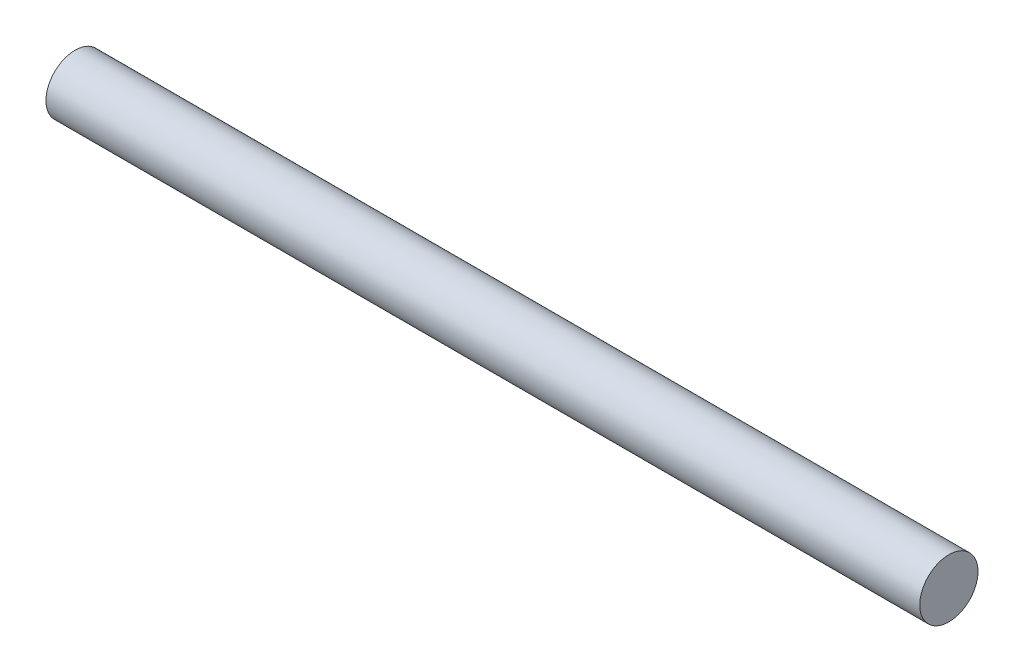
ISO-10303-21;
HEADER;
FILE_DESCRIPTION(('STEP AP214'),'2;1');
FILE_NAME('part.step','',(''),(''),'','','');
FILE_SCHEMA(('AUTOMOTIVE_DESIGN { 1 0 10303 214 1 1 1 1 }'));
ENDSEC;
DATA;
#1=APPLICATION_CONTEXT('core data for automotive mechanical design processes');
#2=APPLICATION_PROTOCOL_DEFINITION('international standard','automotive_design',2000,#1);
#3=PRODUCT_CONTEXT('',#1,'mechanical');
#4=PRODUCT('Part','Part','',(#3));
#5=PRODUCT_RELATED_PRODUCT_CATEGORY('part','',(#4));
#6=PRODUCT_DEFINITION_FORMATION('','',#4);
#7=PRODUCT_DEFINITION_CONTEXT('part definition',#1,'design');
#8=PRODUCT_DEFINITION('design','',#6,#7);
#9=PRODUCT_DEFINITION_SHAPE('','',#8);
#10=(LENGTH_UNIT() NAMED_UNIT(*) SI_UNIT(.MILLI.,.METRE.));
#11=(NAMED_UNIT(*) PLANE_ANGLE_UNIT() SI_UNIT($,.RADIAN.));
#12=(NAMED_UNIT(*) SI_UNIT($,.STERADIAN.) SOLID_ANGLE_UNIT());
#13=UNCERTAINTY_MEASURE_WITH_UNIT(LENGTH_MEASURE(1.E-05),#10,'distance_accuracy_value','');
#14=(GEOMETRIC_REPRESENTATION_CONTEXT(3) GLOBAL_UNCERTAINTY_ASSIGNED_CONTEXT((#13)) GLOBAL_UNIT_ASSIGNED_CONTEXT((#10,
#11,#12)) REPRESENTATION_CONTEXT('',''));
#15=CARTESIAN_POINT('',(0.,0.,0.));
#16=DIRECTION('',(0.,0.,1.));
#17=DIRECTION('',(1.,0.,0.));
#18=AXIS2_PLACEMENT_3D('',#15,#16,#17);
#19=CARTESIAN_POINT('',(120.,0.,0.));
#20=DIRECTION('',(-1.,0.,0.));
#21=DIRECTION('',(0.,0.,1.));
#22=AXIS2_PLACEMENT_3D('',#19,#20,#21);
#23=CYLINDRICAL_SURFACE('',#22,4.);
#24=CARTESIAN_POINT('',(120.,0.,0.));
#25=DIRECTION('',(1.,0.,0.));
#26=DIRECTION('',(0.,0.,-1.));
#27=AXIS2_PLACEMENT_3D('',#24,#25,#26);
#28=CIRCLE('',#27,4.);
#29=CARTESIAN_POINT('',(120.,0.,-4.));
#30=VERTEX_POINT('',#29);
#31=EDGE_CURVE('E10',#30,#30,#28,.T.);
#32=ORIENTED_EDGE('',*,*,#31,.F.);
#33=EDGE_LOOP('',(#32));
#34=FACE_BOUND('',#33,.T.);
#35=CARTESIAN_POINT('',(0.,0.,0.));
#36=DIRECTION('',(1.,0.,0.));
#37=DIRECTION('',(0.,0.,-1.));
#38=AXIS2_PLACEMENT_3D('',#35,#36,#37);
#39=CIRCLE('',#38,4.);
#40=CARTESIAN_POINT('',(0.,0.,-4.));
#41=VERTEX_POINT('',#40);
#42=EDGE_CURVE('E34',#41,#41,#39,.T.);
#43=ORIENTED_EDGE('',*,*,#42,.T.);
#44=EDGE_LOOP('',(#43));
#45=FACE_BOUND('',#44,.T.);
#46=ADVANCED_FACE('F31',(#34,#45),#23,.T.);
#47=CARTESIAN_POINT('',(120.,0.,0.));
#48=DIRECTION('',(1.,0.,0.));
#49=DIRECTION('',(0.,0.,-1.));
#50=AXIS2_PLACEMENT_3D('',#47,#48,#49);
#51=PLANE('',#50);
#52=ORIENTED_EDGE('',*,*,#31,.T.);
#53=EDGE_LOOP('',(#52));
#54=FACE_BOUND('',#53,.T.);
#55=ADVANCED_FACE('F46',(#54),#51,.T.);
#56=CARTESIAN_POINT('',(0.,0.,0.));
#57=DIRECTION('',(1.,0.,0.));
#58=DIRECTION('',(0.,0.,-1.));
#59=AXIS2_PLACEMENT_3D('',#56,#57,#58);
#60=PLANE('',#59);
#61=ORIENTED_EDGE('',*,*,#42,.F.);
#62=EDGE_LOOP('',(#61));
#63=FACE_BOUND('',#62,.T.);
#64=ADVANCED_FACE('F44',(#63),#60,.F.);
#65=CLOSED_SHELL('',(#46,#55,#64));
#66=MANIFOLD_SOLID_BREP('B2',#65);
#67=ADVANCED_BREP_SHAPE_REPRESENTATION('',(#18,#66),#14);
#68=SHAPE_DEFINITION_REPRESENTATION(#9,#67);
ENDSEC;
END-ISO-10303-21;
